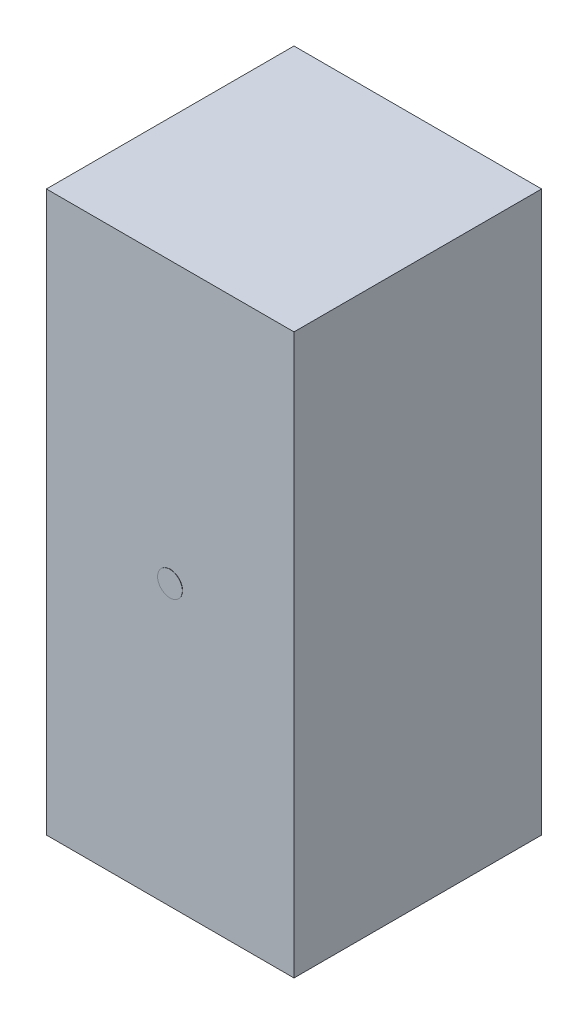
ISO-10303-21;
HEADER;
FILE_DESCRIPTION(('STEP AP214'),'2;1');
FILE_NAME('part.step','',(''),(''),'','','');
FILE_SCHEMA(('AUTOMOTIVE_DESIGN { 1 0 10303 214 1 1 1 1 }'));
ENDSEC;
DATA;
#1=APPLICATION_CONTEXT('core data for automotive mechanical design processes');
#2=APPLICATION_PROTOCOL_DEFINITION('international standard','automotive_design',2000,#1);
#3=PRODUCT_CONTEXT('',#1,'mechanical');
#4=PRODUCT('Part','Part','',(#3));
#5=PRODUCT_RELATED_PRODUCT_CATEGORY('part','',(#4));
#6=PRODUCT_DEFINITION_FORMATION('','',#4);
#7=PRODUCT_DEFINITION_CONTEXT('part definition',#1,'design');
#8=PRODUCT_DEFINITION('design','',#6,#7);
#9=PRODUCT_DEFINITION_SHAPE('','',#8);
#10=(LENGTH_UNIT() NAMED_UNIT(*) SI_UNIT(.MILLI.,.METRE.));
#11=(NAMED_UNIT(*) PLANE_ANGLE_UNIT() SI_UNIT($,.RADIAN.));
#12=(NAMED_UNIT(*) SI_UNIT($,.STERADIAN.) SOLID_ANGLE_UNIT());
#13=UNCERTAINTY_MEASURE_WITH_UNIT(LENGTH_MEASURE(1.E-05),#10,'distance_accuracy_value','');
#14=(GEOMETRIC_REPRESENTATION_CONTEXT(3) GLOBAL_UNCERTAINTY_ASSIGNED_CONTEXT((#13)) GLOBAL_UNIT_ASSIGNED_CONTEXT((#10,
#11,#12)) REPRESENTATION_CONTEXT('',''));
#15=CARTESIAN_POINT('',(0.,0.,0.));
#16=DIRECTION('',(0.,0.,1.));
#17=DIRECTION('',(1.,0.,0.));
#18=AXIS2_PLACEMENT_3D('',#15,#16,#17);
#19=CARTESIAN_POINT('',(50.,226.,-50.));
#20=DIRECTION('',(-1.,0.,0.));
#21=DIRECTION('',(0.,0.,1.));
#22=AXIS2_PLACEMENT_3D('',#19,#20,#21);
#23=PLANE('',#22);
#24=DIRECTION('',(0.,0.,-1.));
#25=VECTOR('',#24,1.);
#26=CARTESIAN_POINT('',(50.,0.,-50.));
#27=LINE('',#26,#25);
#28=CARTESIAN_POINT('',(50.,0.,50.));
#29=VERTEX_POINT('',#28);
#30=CARTESIAN_POINT('',(50.,0.,-50.));
#31=VERTEX_POINT('',#30);
#32=EDGE_CURVE('E110',#29,#31,#27,.T.);
#33=ORIENTED_EDGE('',*,*,#32,.T.);
#34=DIRECTION('',(0.,-1.,0.));
#35=VECTOR('',#34,1.);
#36=CARTESIAN_POINT('',(50.,226.,-50.));
#37=LINE('',#36,#35);
#38=CARTESIAN_POINT('',(50.,226.,-50.));
#39=VERTEX_POINT('',#38);
#40=EDGE_CURVE('E52',#39,#31,#37,.T.);
#41=ORIENTED_EDGE('',*,*,#40,.F.);
#42=DIRECTION('',(0.,0.,-1.));
#43=VECTOR('',#42,1.);
#44=CARTESIAN_POINT('',(50.,226.,-50.));
#45=LINE('',#44,#43);
#46=CARTESIAN_POINT('',(50.,226.,50.));
#47=VERTEX_POINT('',#46);
#48=EDGE_CURVE('E96',#47,#39,#45,.T.);
#49=ORIENTED_EDGE('',*,*,#48,.F.);
#50=DIRECTION('',(0.,-1.,0.));
#51=VECTOR('',#50,1.);
#52=CARTESIAN_POINT('',(50.,226.,50.));
#53=LINE('',#52,#51);
#54=EDGE_CURVE('E106',#47,#29,#53,.T.);
#55=ORIENTED_EDGE('',*,*,#54,.T.);
#56=EDGE_LOOP('',(#33,#41,#49,#55));
#57=FACE_BOUND('',#56,.T.);
#58=ADVANCED_FACE('F44',(#57),#23,.F.);
#59=CARTESIAN_POINT('',(-50.,226.,-50.));
#60=DIRECTION('',(0.,0.,1.));
#61=DIRECTION('',(1.,0.,0.));
#62=AXIS2_PLACEMENT_3D('',#59,#60,#61);
#63=PLANE('',#62);
#64=DIRECTION('',(-1.,0.,0.));
#65=VECTOR('',#64,1.);
#66=CARTESIAN_POINT('',(-50.,0.,-50.));
#67=LINE('',#66,#65);
#68=CARTESIAN_POINT('',(-50.,0.,-50.));
#69=VERTEX_POINT('',#68);
#70=EDGE_CURVE('E101',#31,#69,#67,.T.);
#71=ORIENTED_EDGE('',*,*,#70,.T.);
#72=DIRECTION('',(0.,-1.,0.));
#73=VECTOR('',#72,1.);
#74=CARTESIAN_POINT('',(-50.,226.,-50.));
#75=LINE('',#74,#73);
#76=CARTESIAN_POINT('',(-50.,226.,-50.));
#77=VERTEX_POINT('',#76);
#78=EDGE_CURVE('E99',#77,#69,#75,.T.);
#79=ORIENTED_EDGE('',*,*,#78,.F.);
#80=DIRECTION('',(-1.,0.,0.));
#81=VECTOR('',#80,1.);
#82=CARTESIAN_POINT('',(-50.,226.,-50.));
#83=LINE('',#82,#81);
#84=EDGE_CURVE('E91',#39,#77,#83,.T.);
#85=ORIENTED_EDGE('',*,*,#84,.F.);
#86=ORIENTED_EDGE('',*,*,#40,.T.);
#87=EDGE_LOOP('',(#71,#79,#85,#86));
#88=FACE_BOUND('',#87,.T.);
#89=ADVANCED_FACE('F100',(#88),#63,.F.);
#90=CARTESIAN_POINT('',(-50.,226.,-50.));
#91=DIRECTION('',(1.,0.,0.));
#92=DIRECTION('',(0.,0.,-1.));
#93=AXIS2_PLACEMENT_3D('',#90,#91,#92);
#94=PLANE('',#93);
#95=DIRECTION('',(0.,0.,1.));
#96=VECTOR('',#95,1.);
#97=CARTESIAN_POINT('',(-50.,0.,-50.));
#98=LINE('',#97,#96);
#99=CARTESIAN_POINT('',(-50.,0.,50.));
#100=VERTEX_POINT('',#99);
#101=EDGE_CURVE('E77',#69,#100,#98,.T.);
#102=ORIENTED_EDGE('',*,*,#101,.T.);
#103=DIRECTION('',(0.,-1.,0.));
#104=VECTOR('',#103,1.);
#105=CARTESIAN_POINT('',(-50.,226.,50.));
#106=LINE('',#105,#104);
#107=CARTESIAN_POINT('',(-50.,226.,50.));
#108=VERTEX_POINT('',#107);
#109=EDGE_CURVE('E102',#108,#100,#106,.T.);
#110=ORIENTED_EDGE('',*,*,#109,.F.);
#111=DIRECTION('',(0.,0.,1.));
#112=VECTOR('',#111,1.);
#113=CARTESIAN_POINT('',(-50.,226.,-50.));
#114=LINE('',#113,#112);
#115=EDGE_CURVE('E94',#77,#108,#114,.T.);
#116=ORIENTED_EDGE('',*,*,#115,.F.);
#117=ORIENTED_EDGE('',*,*,#78,.T.);
#118=EDGE_LOOP('',(#102,#110,#116,#117));
#119=FACE_BOUND('',#118,.T.);
#120=ADVANCED_FACE('F104',(#119),#94,.F.);
#121=CARTESIAN_POINT('',(-50.,226.,50.));
#122=DIRECTION('',(0.,0.,-1.));
#123=DIRECTION('',(-1.,0.,0.));
#124=AXIS2_PLACEMENT_3D('',#121,#122,#123);
#125=PLANE('',#124);
#126=CARTESIAN_POINT('',(0.,113.,50.));
#127=DIRECTION('',(0.,0.,-1.));
#128=DIRECTION('',(-1.,0.,0.));
#129=AXIS2_PLACEMENT_3D('',#126,#127,#128);
#130=CIRCLE('',#129,5.);
#131=CARTESIAN_POINT('',(-5.,113.,50.));
#132=VERTEX_POINT('',#131);
#133=EDGE_CURVE('E11',#132,#132,#130,.F.);
#134=ORIENTED_EDGE('',*,*,#133,.F.);
#135=EDGE_LOOP('',(#134));
#136=FACE_BOUND('',#135,.T.);
#137=DIRECTION('',(1.,0.,0.));
#138=VECTOR('',#137,1.);
#139=CARTESIAN_POINT('',(-50.,0.,50.));
#140=LINE('',#139,#138);
#141=EDGE_CURVE('E83',#100,#29,#140,.T.);
#142=ORIENTED_EDGE('',*,*,#141,.T.);
#143=ORIENTED_EDGE('',*,*,#54,.F.);
#144=DIRECTION('',(1.,0.,0.));
#145=VECTOR('',#144,1.);
#146=CARTESIAN_POINT('',(-50.,226.,50.));
#147=LINE('',#146,#145);
#148=EDGE_CURVE('E60',#108,#47,#147,.T.);
#149=ORIENTED_EDGE('',*,*,#148,.F.);
#150=ORIENTED_EDGE('',*,*,#109,.T.);
#151=EDGE_LOOP('',(#142,#143,#149,#150));
#152=FACE_BOUND('',#151,.T.);
#153=ADVANCED_FACE('F132',(#136,#152),#125,.F.);
#154=CARTESIAN_POINT('',(0.,226.,0.));
#155=DIRECTION('',(0.,1.,0.));
#156=DIRECTION('',(0.,0.,1.));
#157=AXIS2_PLACEMENT_3D('',#154,#155,#156);
#158=PLANE('',#157);
#159=ORIENTED_EDGE('',*,*,#48,.T.);
#160=ORIENTED_EDGE('',*,*,#84,.T.);
#161=ORIENTED_EDGE('',*,*,#115,.T.);
#162=ORIENTED_EDGE('',*,*,#148,.T.);
#163=EDGE_LOOP('',(#159,#160,#161,#162));
#164=FACE_BOUND('',#163,.T.);
#165=ADVANCED_FACE('F92',(#164),#158,.T.);
#166=CARTESIAN_POINT('',(0.,0.,0.));
#167=DIRECTION('',(0.,1.,0.));
#168=DIRECTION('',(0.,0.,1.));
#169=AXIS2_PLACEMENT_3D('',#166,#167,#168);
#170=PLANE('',#169);
#171=ORIENTED_EDGE('',*,*,#32,.F.);
#172=ORIENTED_EDGE('',*,*,#141,.F.);
#173=ORIENTED_EDGE('',*,*,#101,.F.);
#174=ORIENTED_EDGE('',*,*,#70,.F.);
#175=EDGE_LOOP('',(#171,#172,#173,#174));
#176=FACE_BOUND('',#175,.T.);
#177=ADVANCED_FACE('F121',(#176),#170,.F.);
#178=CARTESIAN_POINT('',(0.,113.,50.1));
#179=DIRECTION('',(0.,0.,-1.));
#180=DIRECTION('',(-1.,0.,0.));
#181=AXIS2_PLACEMENT_3D('',#178,#179,#180);
#182=CYLINDRICAL_SURFACE('',#181,5.);
#183=CARTESIAN_POINT('',(0.,113.,50.1));
#184=DIRECTION('',(0.,0.,1.));
#185=DIRECTION('',(1.,0.,0.));
#186=AXIS2_PLACEMENT_3D('',#183,#184,#185);
#187=CIRCLE('',#186,5.);
#188=CARTESIAN_POINT('',(5.,113.,50.1));
#189=VERTEX_POINT('',#188);
#190=EDGE_CURVE('E113',#189,#189,#187,.T.);
#191=ORIENTED_EDGE('',*,*,#190,.F.);
#192=EDGE_LOOP('',(#191));
#193=FACE_BOUND('',#192,.T.);
#194=ORIENTED_EDGE('',*,*,#133,.T.);
#195=EDGE_LOOP('',(#194));
#196=FACE_BOUND('',#195,.T.);
#197=ADVANCED_FACE('F123',(#193,#196),#182,.T.);
#198=CARTESIAN_POINT('',(0.,113.,50.1));
#199=DIRECTION('',(0.,0.,1.));
#200=DIRECTION('',(1.,0.,0.));
#201=AXIS2_PLACEMENT_3D('',#198,#199,#200);
#202=PLANE('',#201);
#203=ORIENTED_EDGE('',*,*,#190,.T.);
#204=EDGE_LOOP('',(#203));
#205=FACE_BOUND('',#204,.T.);
#206=ADVANCED_FACE('F129',(#205),#202,.T.);
#207=CLOSED_SHELL('',(#58,#89,#120,#153,#165,#177,#197,#206));
#208=MANIFOLD_SOLID_BREP('B2',#207);
#209=ADVANCED_BREP_SHAPE_REPRESENTATION('',(#18,#208),#14);
#210=SHAPE_DEFINITION_REPRESENTATION(#9,#209);
ENDSEC;
END-ISO-10303-21;
